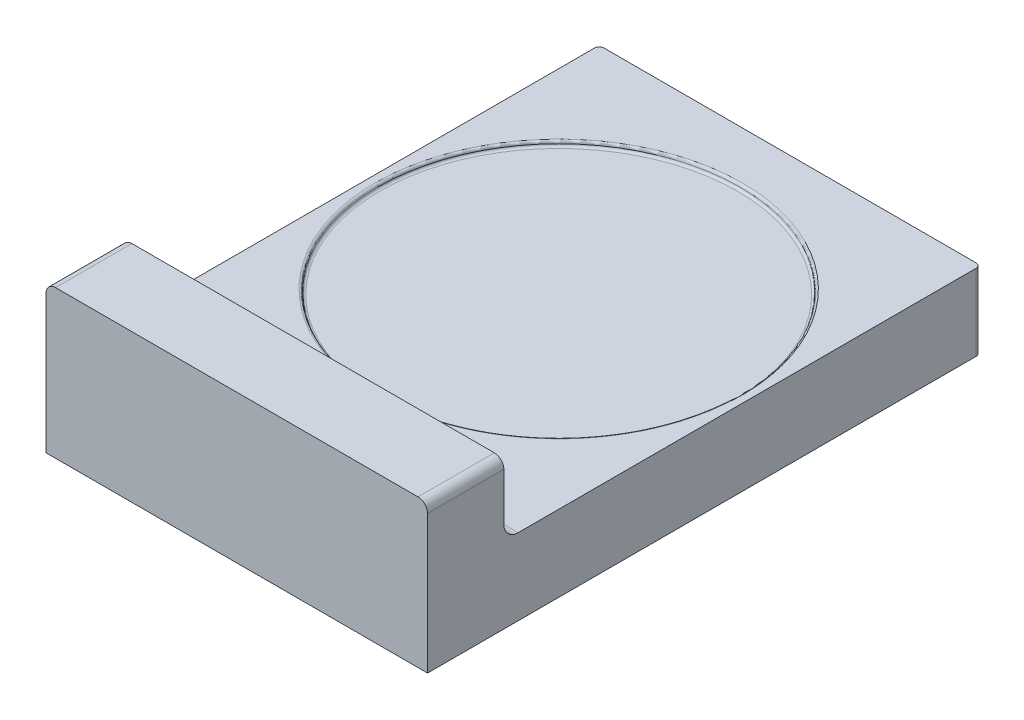
ISO-10303-21;
HEADER;
FILE_DESCRIPTION(('STEP AP214'),'2;1');
FILE_NAME('part.step','',(''),(''),'','','');
FILE_SCHEMA(('AUTOMOTIVE_DESIGN { 1 0 10303 214 1 1 1 1 }'));
ENDSEC;
DATA;
#1=APPLICATION_CONTEXT('core data for automotive mechanical design processes');
#2=APPLICATION_PROTOCOL_DEFINITION('international standard','automotive_design',2000,#1);
#3=PRODUCT_CONTEXT('',#1,'mechanical');
#4=PRODUCT('Part','Part','',(#3));
#5=PRODUCT_RELATED_PRODUCT_CATEGORY('part','',(#4));
#6=PRODUCT_DEFINITION_FORMATION('','',#4);
#7=PRODUCT_DEFINITION_CONTEXT('part definition',#1,'design');
#8=PRODUCT_DEFINITION('design','',#6,#7);
#9=PRODUCT_DEFINITION_SHAPE('','',#8);
#10=(LENGTH_UNIT() NAMED_UNIT(*) SI_UNIT(.MILLI.,.METRE.));
#11=(NAMED_UNIT(*) PLANE_ANGLE_UNIT() SI_UNIT($,.RADIAN.));
#12=(NAMED_UNIT(*) SI_UNIT($,.STERADIAN.) SOLID_ANGLE_UNIT());
#13=UNCERTAINTY_MEASURE_WITH_UNIT(LENGTH_MEASURE(1.E-05),#10,'distance_accuracy_value','');
#14=(GEOMETRIC_REPRESENTATION_CONTEXT(3) GLOBAL_UNCERTAINTY_ASSIGNED_CONTEXT((#13)) GLOBAL_UNIT_ASSIGNED_CONTEXT((#10,
#11,#12)) REPRESENTATION_CONTEXT('',''));
#15=CARTESIAN_POINT('',(0.,0.,0.));
#16=DIRECTION('',(0.,0.,1.));
#17=DIRECTION('',(1.,0.,0.));
#18=AXIS2_PLACEMENT_3D('',#15,#16,#17);
#19=CARTESIAN_POINT('',(400.,80.,0.));
#20=DIRECTION('',(0.,-1.,0.));
#21=DIRECTION('',(0.,0.,-1.));
#22=AXIS2_PLACEMENT_3D('',#19,#20,#21);
#23=PLANE('',#22);
#24=CARTESIAN_POINT('',(200.,80.,-337.5));
#25=DIRECTION('',(0.,-1.,0.));
#26=DIRECTION('',(0.,0.,-1.));
#27=AXIS2_PLACEMENT_3D('',#24,#25,#26);
#28=CIRCLE('',#27,192.5);
#29=CARTESIAN_POINT('',(200.,80.,-530.));
#30=VERTEX_POINT('',#29);
#31=EDGE_CURVE('E11',#30,#30,#28,.T.);
#32=ORIENTED_EDGE('',*,*,#31,.T.);
#33=EDGE_LOOP('',(#32));
#34=FACE_BOUND('',#33,.T.);
#35=DIRECTION('',(0.,0.,1.));
#36=VECTOR('',#35,1.);
#37=CARTESIAN_POINT('',(0.,80.,0.));
#38=LINE('',#37,#36);
#39=CARTESIAN_POINT('',(0.,80.,-575.));
#40=VERTEX_POINT('',#39);
#41=CARTESIAN_POINT('',(0.,80.,-95.));
#42=VERTEX_POINT('',#41);
#43=EDGE_CURVE('E138',#40,#42,#38,.T.);
#44=ORIENTED_EDGE('',*,*,#43,.T.);
#45=DIRECTION('',(-1.,0.,0.));
#46=VECTOR('',#45,1.);
#47=CARTESIAN_POINT('',(400.,80.,-95.));
#48=LINE('',#47,#46);
#49=CARTESIAN_POINT('',(400.,80.,-95.));
#50=VERTEX_POINT('',#49);
#51=EDGE_CURVE('E55',#42,#50,#48,.F.);
#52=ORIENTED_EDGE('',*,*,#51,.T.);
#53=DIRECTION('',(0.,0.,1.));
#54=VECTOR('',#53,1.);
#55=CARTESIAN_POINT('',(400.,80.,0.));
#56=LINE('',#55,#54);
#57=CARTESIAN_POINT('',(400.,80.,-575.));
#58=VERTEX_POINT('',#57);
#59=EDGE_CURVE('E149',#58,#50,#56,.T.);
#60=ORIENTED_EDGE('',*,*,#59,.F.);
#61=CARTESIAN_POINT('',(395.,80.,-575.));
#62=DIRECTION('',(0.,-1.,0.));
#63=DIRECTION('',(0.,0.,-1.));
#64=AXIS2_PLACEMENT_3D('',#61,#62,#63);
#65=CIRCLE('',#64,5.);
#66=CARTESIAN_POINT('',(395.,80.,-580.));
#67=VERTEX_POINT('',#66);
#68=EDGE_CURVE('E197',#58,#67,#65,.F.);
#69=ORIENTED_EDGE('',*,*,#68,.T.);
#70=DIRECTION('',(-1.,0.,0.));
#71=VECTOR('',#70,1.);
#72=CARTESIAN_POINT('',(400.,80.,-580.));
#73=LINE('',#72,#71);
#74=CARTESIAN_POINT('',(5.,80.,-580.));
#75=VERTEX_POINT('',#74);
#76=EDGE_CURVE('E166',#67,#75,#73,.T.);
#77=ORIENTED_EDGE('',*,*,#76,.T.);
#78=CARTESIAN_POINT('',(5.,80.,-575.));
#79=DIRECTION('',(0.,-1.,0.));
#80=DIRECTION('',(0.,0.,-1.));
#81=AXIS2_PLACEMENT_3D('',#78,#79,#80);
#82=CIRCLE('',#81,5.);
#83=EDGE_CURVE('E200',#75,#40,#82,.F.);
#84=ORIENTED_EDGE('',*,*,#83,.T.);
#85=EDGE_LOOP('',(#44,#52,#60,#69,#77,#84));
#86=FACE_BOUND('',#85,.T.);
#87=ADVANCED_FACE('F38',(#34,#86),#23,.F.);
#88=CARTESIAN_POINT('',(400.,0.,0.));
#89=DIRECTION('',(0.,0.,-1.));
#90=DIRECTION('',(-1.,0.,0.));
#91=AXIS2_PLACEMENT_3D('',#88,#89,#90);
#92=PLANE('',#91);
#93=DIRECTION('',(1.,0.,0.));
#94=VECTOR('',#93,1.);
#95=CARTESIAN_POINT('',(0.,155.,0.));
#96=LINE('',#95,#94);
#97=CARTESIAN_POINT('',(10.,155.,0.));
#98=VERTEX_POINT('',#97);
#99=CARTESIAN_POINT('',(390.,155.,0.));
#100=VERTEX_POINT('',#99);
#101=EDGE_CURVE('E319',#98,#100,#96,.T.);
#102=ORIENTED_EDGE('',*,*,#101,.F.);
#103=CARTESIAN_POINT('',(10.,145.,0.));
#104=DIRECTION('',(0.,0.,-1.));
#105=DIRECTION('',(-1.,0.,0.));
#106=AXIS2_PLACEMENT_3D('',#103,#104,#105);
#107=CIRCLE('',#106,10.);
#108=CARTESIAN_POINT('',(0.,145.,0.));
#109=VERTEX_POINT('',#108);
#110=EDGE_CURVE('E176',#98,#109,#107,.F.);
#111=ORIENTED_EDGE('',*,*,#110,.T.);
#112=DIRECTION('',(0.,-1.,0.));
#113=VECTOR('',#112,1.);
#114=CARTESIAN_POINT('',(0.,0.,0.));
#115=LINE('',#114,#113);
#116=CARTESIAN_POINT('',(0.,0.,0.));
#117=VERTEX_POINT('',#116);
#118=EDGE_CURVE('E154',#109,#117,#115,.T.);
#119=ORIENTED_EDGE('',*,*,#118,.T.);
#120=DIRECTION('',(-1.,0.,0.));
#121=VECTOR('',#120,1.);
#122=CARTESIAN_POINT('',(400.,0.,0.));
#123=LINE('',#122,#121);
#124=CARTESIAN_POINT('',(400.,0.,0.));
#125=VERTEX_POINT('',#124);
#126=EDGE_CURVE('E144',#125,#117,#123,.T.);
#127=ORIENTED_EDGE('',*,*,#126,.F.);
#128=DIRECTION('',(0.,-1.,0.));
#129=VECTOR('',#128,1.);
#130=CARTESIAN_POINT('',(400.,0.,0.));
#131=LINE('',#130,#129);
#132=CARTESIAN_POINT('',(400.,145.,0.));
#133=VERTEX_POINT('',#132);
#134=EDGE_CURVE('E125',#133,#125,#131,.T.);
#135=ORIENTED_EDGE('',*,*,#134,.F.);
#136=CARTESIAN_POINT('',(390.,145.,0.));
#137=DIRECTION('',(0.,0.,-1.));
#138=DIRECTION('',(-1.,0.,0.));
#139=AXIS2_PLACEMENT_3D('',#136,#137,#138);
#140=CIRCLE('',#139,10.);
#141=EDGE_CURVE('E173',#133,#100,#140,.F.);
#142=ORIENTED_EDGE('',*,*,#141,.T.);
#143=EDGE_LOOP('',(#102,#111,#119,#127,#135,#142));
#144=FACE_BOUND('',#143,.T.);
#145=ADVANCED_FACE('F152',(#144),#92,.F.);
#146=CARTESIAN_POINT('',(400.,0.,0.));
#147=DIRECTION('',(0.,1.,0.));
#148=DIRECTION('',(0.,0.,1.));
#149=AXIS2_PLACEMENT_3D('',#146,#147,#148);
#150=PLANE('',#149);
#151=DIRECTION('',(0.,0.,-1.));
#152=VECTOR('',#151,1.);
#153=CARTESIAN_POINT('',(0.,0.,0.));
#154=LINE('',#153,#152);
#155=CARTESIAN_POINT('',(0.,0.,-575.));
#156=VERTEX_POINT('',#155);
#157=EDGE_CURVE('E293',#117,#156,#154,.T.);
#158=ORIENTED_EDGE('',*,*,#157,.T.);
#159=CARTESIAN_POINT('',(5.,0.,-575.));
#160=DIRECTION('',(0.,1.,0.));
#161=DIRECTION('',(0.,0.,1.));
#162=AXIS2_PLACEMENT_3D('',#159,#160,#161);
#163=CIRCLE('',#162,5.);
#164=CARTESIAN_POINT('',(5.,0.,-580.));
#165=VERTEX_POINT('',#164);
#166=EDGE_CURVE('E208',#156,#165,#163,.F.);
#167=ORIENTED_EDGE('',*,*,#166,.T.);
#168=DIRECTION('',(-1.,0.,0.));
#169=VECTOR('',#168,1.);
#170=CARTESIAN_POINT('',(400.,0.,-580.));
#171=LINE('',#170,#169);
#172=CARTESIAN_POINT('',(395.,0.,-580.));
#173=VERTEX_POINT('',#172);
#174=EDGE_CURVE('E158',#173,#165,#171,.T.);
#175=ORIENTED_EDGE('',*,*,#174,.F.);
#176=CARTESIAN_POINT('',(395.,0.,-575.));
#177=DIRECTION('',(0.,1.,0.));
#178=DIRECTION('',(0.,0.,1.));
#179=AXIS2_PLACEMENT_3D('',#176,#177,#178);
#180=CIRCLE('',#179,5.);
#181=CARTESIAN_POINT('',(400.,0.,-575.));
#182=VERTEX_POINT('',#181);
#183=EDGE_CURVE('E147',#173,#182,#180,.F.);
#184=ORIENTED_EDGE('',*,*,#183,.T.);
#185=DIRECTION('',(0.,0.,-1.));
#186=VECTOR('',#185,1.);
#187=CARTESIAN_POINT('',(400.,0.,0.));
#188=LINE('',#187,#186);
#189=EDGE_CURVE('E129',#125,#182,#188,.T.);
#190=ORIENTED_EDGE('',*,*,#189,.F.);
#191=ORIENTED_EDGE('',*,*,#126,.T.);
#192=EDGE_LOOP('',(#158,#167,#175,#184,#190,#191));
#193=FACE_BOUND('',#192,.T.);
#194=ADVANCED_FACE('F143',(#193),#150,.F.);
#195=CARTESIAN_POINT('',(400.,0.,-580.));
#196=DIRECTION('',(0.,0.,1.));
#197=DIRECTION('',(1.,0.,0.));
#198=AXIS2_PLACEMENT_3D('',#195,#196,#197);
#199=PLANE('',#198);
#200=ORIENTED_EDGE('',*,*,#174,.T.);
#201=DIRECTION('',(0.,1.,0.));
#202=VECTOR('',#201,1.);
#203=CARTESIAN_POINT('',(5.,80.,-580.));
#204=LINE('',#203,#202);
#205=EDGE_CURVE('E193',#165,#75,#204,.T.);
#206=ORIENTED_EDGE('',*,*,#205,.T.);
#207=ORIENTED_EDGE('',*,*,#76,.F.);
#208=DIRECTION('',(0.,1.,0.));
#209=VECTOR('',#208,1.);
#210=CARTESIAN_POINT('',(395.,0.,-580.));
#211=LINE('',#210,#209);
#212=EDGE_CURVE('E190',#67,#173,#211,.F.);
#213=ORIENTED_EDGE('',*,*,#212,.T.);
#214=EDGE_LOOP('',(#200,#206,#207,#213));
#215=FACE_BOUND('',#214,.T.);
#216=ADVANCED_FACE('F251',(#215),#199,.F.);
#217=CARTESIAN_POINT('',(400.,0.,0.));
#218=DIRECTION('',(-1.,0.,0.));
#219=DIRECTION('',(0.,0.,1.));
#220=AXIS2_PLACEMENT_3D('',#217,#218,#219);
#221=PLANE('',#220);
#222=ORIENTED_EDGE('',*,*,#189,.T.);
#223=DIRECTION('',(0.,1.,0.));
#224=VECTOR('',#223,1.);
#225=CARTESIAN_POINT('',(400.,0.,-575.));
#226=LINE('',#225,#224);
#227=EDGE_CURVE('E211',#182,#58,#226,.T.);
#228=ORIENTED_EDGE('',*,*,#227,.T.);
#229=ORIENTED_EDGE('',*,*,#59,.T.);
#230=CARTESIAN_POINT('',(400.,95.,-95.));
#231=DIRECTION('',(-1.,0.,0.));
#232=DIRECTION('',(0.,0.,1.));
#233=AXIS2_PLACEMENT_3D('',#230,#231,#232);
#234=CIRCLE('',#233,15.);
#235=CARTESIAN_POINT('',(400.,95.,-80.));
#236=VERTEX_POINT('',#235);
#237=EDGE_CURVE('E222',#50,#236,#234,.T.);
#238=ORIENTED_EDGE('',*,*,#237,.T.);
#239=DIRECTION('',(0.,-1.,0.));
#240=VECTOR('',#239,1.);
#241=CARTESIAN_POINT('',(400.,155.,-80.));
#242=LINE('',#241,#240);
#243=CARTESIAN_POINT('',(400.,145.,-80.));
#244=VERTEX_POINT('',#243);
#245=EDGE_CURVE('E283',#244,#236,#242,.T.);
#246=ORIENTED_EDGE('',*,*,#245,.F.);
#247=DIRECTION('',(0.,0.,-1.));
#248=VECTOR('',#247,1.);
#249=CARTESIAN_POINT('',(400.,145.,0.));
#250=LINE('',#249,#248);
#251=EDGE_CURVE('E133',#244,#133,#250,.F.);
#252=ORIENTED_EDGE('',*,*,#251,.T.);
#253=ORIENTED_EDGE('',*,*,#134,.T.);
#254=EDGE_LOOP('',(#222,#228,#229,#238,#246,#252,#253));
#255=FACE_BOUND('',#254,.T.);
#256=ADVANCED_FACE('F127',(#255),#221,.F.);
#257=CARTESIAN_POINT('',(0.,0.,0.));
#258=DIRECTION('',(-1.,0.,0.));
#259=DIRECTION('',(0.,0.,1.));
#260=AXIS2_PLACEMENT_3D('',#257,#258,#259);
#261=PLANE('',#260);
#262=ORIENTED_EDGE('',*,*,#43,.F.);
#263=DIRECTION('',(0.,1.,0.));
#264=VECTOR('',#263,1.);
#265=CARTESIAN_POINT('',(0.,0.,-575.));
#266=LINE('',#265,#264);
#267=EDGE_CURVE('E203',#40,#156,#266,.F.);
#268=ORIENTED_EDGE('',*,*,#267,.T.);
#269=ORIENTED_EDGE('',*,*,#157,.F.);
#270=ORIENTED_EDGE('',*,*,#118,.F.);
#271=DIRECTION('',(0.,0.,1.));
#272=VECTOR('',#271,1.);
#273=CARTESIAN_POINT('',(0.,145.,-80.));
#274=LINE('',#273,#272);
#275=CARTESIAN_POINT('',(0.,145.,-80.));
#276=VERTEX_POINT('',#275);
#277=EDGE_CURVE('E179',#109,#276,#274,.F.);
#278=ORIENTED_EDGE('',*,*,#277,.T.);
#279=DIRECTION('',(0.,-1.,0.));
#280=VECTOR('',#279,1.);
#281=CARTESIAN_POINT('',(0.,155.,-80.));
#282=LINE('',#281,#280);
#283=CARTESIAN_POINT('',(0.,95.,-80.));
#284=VERTEX_POINT('',#283);
#285=EDGE_CURVE('E289',#276,#284,#282,.T.);
#286=ORIENTED_EDGE('',*,*,#285,.T.);
#287=CARTESIAN_POINT('',(0.,95.,-95.));
#288=DIRECTION('',(-1.,0.,0.));
#289=DIRECTION('',(0.,0.,1.));
#290=AXIS2_PLACEMENT_3D('',#287,#288,#289);
#291=CIRCLE('',#290,15.);
#292=EDGE_CURVE('E63',#284,#42,#291,.F.);
#293=ORIENTED_EDGE('',*,*,#292,.T.);
#294=EDGE_LOOP('',(#262,#268,#269,#270,#278,#286,#293));
#295=FACE_BOUND('',#294,.T.);
#296=ADVANCED_FACE('F249',(#295),#261,.T.);
#297=CARTESIAN_POINT('',(0.,155.,-80.));
#298=DIRECTION('',(0.,0.,1.));
#299=DIRECTION('',(1.,0.,0.));
#300=AXIS2_PLACEMENT_3D('',#297,#298,#299);
#301=PLANE('',#300);
#302=ORIENTED_EDGE('',*,*,#245,.T.);
#303=DIRECTION('',(-1.,0.,0.));
#304=VECTOR('',#303,1.);
#305=CARTESIAN_POINT('',(0.,95.,-80.));
#306=LINE('',#305,#304);
#307=EDGE_CURVE('E214',#236,#284,#306,.T.);
#308=ORIENTED_EDGE('',*,*,#307,.T.);
#309=ORIENTED_EDGE('',*,*,#285,.F.);
#310=CARTESIAN_POINT('',(10.,145.,-80.));
#311=DIRECTION('',(0.,0.,1.));
#312=DIRECTION('',(1.,0.,0.));
#313=AXIS2_PLACEMENT_3D('',#310,#311,#312);
#314=CIRCLE('',#313,10.);
#315=CARTESIAN_POINT('',(10.,155.,-80.));
#316=VERTEX_POINT('',#315);
#317=EDGE_CURVE('E185',#276,#316,#314,.F.);
#318=ORIENTED_EDGE('',*,*,#317,.T.);
#319=DIRECTION('',(-1.,0.,0.));
#320=VECTOR('',#319,1.);
#321=CARTESIAN_POINT('',(0.,155.,-80.));
#322=LINE('',#321,#320);
#323=CARTESIAN_POINT('',(390.,155.,-80.));
#324=VERTEX_POINT('',#323);
#325=EDGE_CURVE('E295',#324,#316,#322,.T.);
#326=ORIENTED_EDGE('',*,*,#325,.F.);
#327=CARTESIAN_POINT('',(390.,145.,-80.));
#328=DIRECTION('',(0.,0.,1.));
#329=DIRECTION('',(1.,0.,0.));
#330=AXIS2_PLACEMENT_3D('',#327,#328,#329);
#331=CIRCLE('',#330,10.);
#332=EDGE_CURVE('E182',#324,#244,#331,.F.);
#333=ORIENTED_EDGE('',*,*,#332,.T.);
#334=EDGE_LOOP('',(#302,#308,#309,#318,#326,#333));
#335=FACE_BOUND('',#334,.T.);
#336=ADVANCED_FACE('F285',(#335),#301,.F.);
#337=CARTESIAN_POINT('',(0.,155.,0.));
#338=DIRECTION('',(0.,-1.,0.));
#339=DIRECTION('',(0.,0.,-1.));
#340=AXIS2_PLACEMENT_3D('',#337,#338,#339);
#341=PLANE('',#340);
#342=ORIENTED_EDGE('',*,*,#325,.T.);
#343=DIRECTION('',(0.,0.,1.));
#344=VECTOR('',#343,1.);
#345=CARTESIAN_POINT('',(10.,155.,0.));
#346=LINE('',#345,#344);
#347=EDGE_CURVE('E163',#316,#98,#346,.T.);
#348=ORIENTED_EDGE('',*,*,#347,.T.);
#349=ORIENTED_EDGE('',*,*,#101,.T.);
#350=DIRECTION('',(0.,0.,-1.));
#351=VECTOR('',#350,1.);
#352=CARTESIAN_POINT('',(390.,155.,0.));
#353=LINE('',#352,#351);
#354=EDGE_CURVE('E157',#100,#324,#353,.T.);
#355=ORIENTED_EDGE('',*,*,#354,.T.);
#356=EDGE_LOOP('',(#342,#348,#349,#355));
#357=FACE_BOUND('',#356,.T.);
#358=ADVANCED_FACE('F261',(#357),#341,.F.);
#359=CARTESIAN_POINT('',(10.,145.,0.));
#360=DIRECTION('',(0.,0.,-1.));
#361=DIRECTION('',(-1.,0.,0.));
#362=AXIS2_PLACEMENT_3D('',#359,#360,#361);
#363=CYLINDRICAL_SURFACE('',#362,10.);
#364=ORIENTED_EDGE('',*,*,#317,.F.);
#365=ORIENTED_EDGE('',*,*,#277,.F.);
#366=ORIENTED_EDGE('',*,*,#110,.F.);
#367=ORIENTED_EDGE('',*,*,#347,.F.);
#368=EDGE_LOOP('',(#364,#365,#366,#367));
#369=FACE_BOUND('',#368,.T.);
#370=ADVANCED_FACE('F257',(#369),#363,.T.);
#371=CARTESIAN_POINT('',(390.,145.,0.));
#372=DIRECTION('',(0.,0.,-1.));
#373=DIRECTION('',(-1.,0.,0.));
#374=AXIS2_PLACEMENT_3D('',#371,#372,#373);
#375=CYLINDRICAL_SURFACE('',#374,10.);
#376=ORIENTED_EDGE('',*,*,#141,.F.);
#377=ORIENTED_EDGE('',*,*,#251,.F.);
#378=ORIENTED_EDGE('',*,*,#332,.F.);
#379=ORIENTED_EDGE('',*,*,#354,.F.);
#380=EDGE_LOOP('',(#376,#377,#378,#379));
#381=FACE_BOUND('',#380,.T.);
#382=ADVANCED_FACE('F260',(#381),#375,.T.);
#383=CARTESIAN_POINT('',(5.,0.,-575.));
#384=DIRECTION('',(0.,-1.,0.));
#385=DIRECTION('',(0.,0.,-1.));
#386=AXIS2_PLACEMENT_3D('',#383,#384,#385);
#387=CYLINDRICAL_SURFACE('',#386,5.);
#388=ORIENTED_EDGE('',*,*,#166,.F.);
#389=ORIENTED_EDGE('',*,*,#267,.F.);
#390=ORIENTED_EDGE('',*,*,#83,.F.);
#391=ORIENTED_EDGE('',*,*,#205,.F.);
#392=EDGE_LOOP('',(#388,#389,#390,#391));
#393=FACE_BOUND('',#392,.T.);
#394=ADVANCED_FACE('F265',(#393),#387,.T.);
#395=CARTESIAN_POINT('',(395.,0.,-575.));
#396=DIRECTION('',(0.,1.,0.));
#397=DIRECTION('',(0.,0.,1.));
#398=AXIS2_PLACEMENT_3D('',#395,#396,#397);
#399=CYLINDRICAL_SURFACE('',#398,5.);
#400=ORIENTED_EDGE('',*,*,#183,.F.);
#401=ORIENTED_EDGE('',*,*,#212,.F.);
#402=ORIENTED_EDGE('',*,*,#68,.F.);
#403=ORIENTED_EDGE('',*,*,#227,.F.);
#404=EDGE_LOOP('',(#400,#401,#402,#403));
#405=FACE_BOUND('',#404,.T.);
#406=ADVANCED_FACE('F269',(#405),#399,.T.);
#407=CARTESIAN_POINT('',(0.,95.,-95.));
#408=DIRECTION('',(1.,0.,0.));
#409=DIRECTION('',(0.,0.,-1.));
#410=AXIS2_PLACEMENT_3D('',#407,#408,#409);
#411=CYLINDRICAL_SURFACE('',#410,15.);
#412=ORIENTED_EDGE('',*,*,#237,.F.);
#413=ORIENTED_EDGE('',*,*,#51,.F.);
#414=ORIENTED_EDGE('',*,*,#292,.F.);
#415=ORIENTED_EDGE('',*,*,#307,.F.);
#416=EDGE_LOOP('',(#412,#413,#414,#415));
#417=FACE_BOUND('',#416,.T.);
#418=ADVANCED_FACE('F272',(#417),#411,.F.);
#419=CARTESIAN_POINT('',(200.,75.,-337.5));
#420=DIRECTION('',(0.,1.,0.));
#421=DIRECTION('',(0.,0.,1.));
#422=AXIS2_PLACEMENT_3D('',#419,#420,#421);
#423=PLANE('',#422);
#424=CARTESIAN_POINT('',(200.,75.,-337.5));
#425=DIRECTION('',(0.,1.,0.));
#426=DIRECTION('',(0.,0.,1.));
#427=AXIS2_PLACEMENT_3D('',#424,#425,#426);
#428=CIRCLE('',#427,187.5);
#429=CARTESIAN_POINT('',(200.,75.,-150.));
#430=VERTEX_POINT('',#429);
#431=EDGE_CURVE('E48',#430,#430,#428,.T.);
#432=ORIENTED_EDGE('',*,*,#431,.T.);
#433=EDGE_LOOP('',(#432));
#434=FACE_BOUND('',#433,.T.);
#435=ADVANCED_FACE('F229',(#434),#423,.T.);
#436=CARTESIAN_POINT('',(200.,77.5,-337.5));
#437=DIRECTION('',(0.,-1.,0.));
#438=DIRECTION('',(0.,0.,-1.));
#439=AXIS2_PLACEMENT_3D('',#436,#437,#438);
#440=TOROIDAL_SURFACE('',#439,192.5,2.5);
#441=ORIENTED_EDGE('',*,*,#31,.F.);
#442=EDGE_LOOP('',(#441));
#443=FACE_BOUND('',#442,.T.);
#444=CARTESIAN_POINT('',(200.,77.5,-337.5));
#445=DIRECTION('',(0.,-1.,0.));
#446=DIRECTION('',(0.,0.,-1.));
#447=AXIS2_PLACEMENT_3D('',#444,#445,#446);
#448=CIRCLE('',#447,190.);
#449=CARTESIAN_POINT('',(200.,77.5,-527.5));
#450=VERTEX_POINT('',#449);
#451=EDGE_CURVE('E42',#450,#450,#448,.F.);
#452=ORIENTED_EDGE('',*,*,#451,.F.);
#453=EDGE_LOOP('',(#452));
#454=FACE_BOUND('',#453,.T.);
#455=ADVANCED_FACE('F40',(#443,#454),#440,.T.);
#456=CARTESIAN_POINT('',(200.,77.5,-337.5));
#457=DIRECTION('',(0.,1.,0.));
#458=DIRECTION('',(0.,0.,1.));
#459=AXIS2_PLACEMENT_3D('',#456,#457,#458);
#460=TOROIDAL_SURFACE('',#459,187.5,2.5);
#461=ORIENTED_EDGE('',*,*,#451,.T.);
#462=EDGE_LOOP('',(#461));
#463=FACE_BOUND('',#462,.T.);
#464=ORIENTED_EDGE('',*,*,#431,.F.);
#465=EDGE_LOOP('',(#464));
#466=FACE_BOUND('',#465,.T.);
#467=ADVANCED_FACE('F231',(#463,#466),#460,.F.);
#468=CLOSED_SHELL('',(#87,#145,#194,#216,#256,#296,#336,#358,#370,#382,#394,#406,#418,#435,#455,#467));
#469=MANIFOLD_SOLID_BREP('B2',#468);
#470=ADVANCED_BREP_SHAPE_REPRESENTATION('',(#18,#469),#14);
#471=SHAPE_DEFINITION_REPRESENTATION(#9,#470);
ENDSEC;
END-ISO-10303-21;
